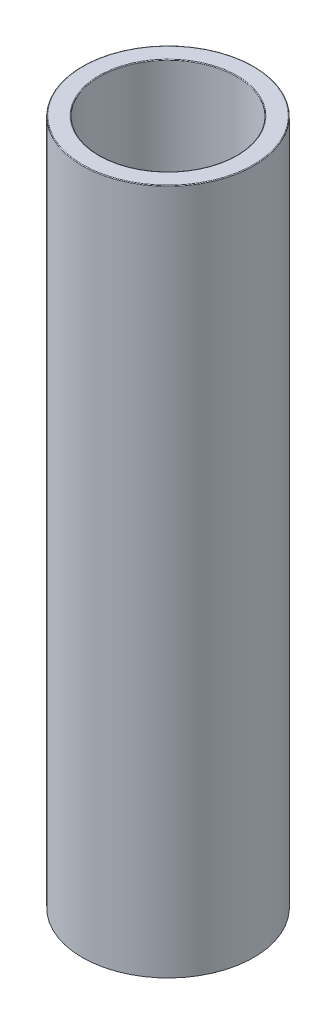
ISO-10303-21;
HEADER;
FILE_DESCRIPTION(('STEP AP214'),'2;1');
FILE_NAME('part.step','',(''),(''),'','','');
FILE_SCHEMA(('AUTOMOTIVE_DESIGN { 1 0 10303 214 1 1 1 1 }'));
ENDSEC;
DATA;
#1=APPLICATION_CONTEXT('core data for automotive mechanical design processes');
#2=APPLICATION_PROTOCOL_DEFINITION('international standard','automotive_design',2000,#1);
#3=PRODUCT_CONTEXT('',#1,'mechanical');
#4=PRODUCT('Part','Part','',(#3));
#5=PRODUCT_RELATED_PRODUCT_CATEGORY('part','',(#4));
#6=PRODUCT_DEFINITION_FORMATION('','',#4);
#7=PRODUCT_DEFINITION_CONTEXT('part definition',#1,'design');
#8=PRODUCT_DEFINITION('design','',#6,#7);
#9=PRODUCT_DEFINITION_SHAPE('','',#8);
#10=(LENGTH_UNIT() NAMED_UNIT(*) SI_UNIT(.MILLI.,.METRE.));
#11=(NAMED_UNIT(*) PLANE_ANGLE_UNIT() SI_UNIT($,.RADIAN.));
#12=(NAMED_UNIT(*) SI_UNIT($,.STERADIAN.) SOLID_ANGLE_UNIT());
#13=UNCERTAINTY_MEASURE_WITH_UNIT(LENGTH_MEASURE(1.E-05),#10,'distance_accuracy_value','');
#14=(GEOMETRIC_REPRESENTATION_CONTEXT(3) GLOBAL_UNCERTAINTY_ASSIGNED_CONTEXT((#13)) GLOBAL_UNIT_ASSIGNED_CONTEXT((#10,
#11,#12)) REPRESENTATION_CONTEXT('',''));
#15=CARTESIAN_POINT('',(0.,0.,0.));
#16=DIRECTION('',(0.,0.,1.));
#17=DIRECTION('',(1.,0.,0.));
#18=AXIS2_PLACEMENT_3D('',#15,#16,#17);
#19=CARTESIAN_POINT('',(0.,10.,0.));
#20=DIRECTION('',(0.,1.,0.));
#21=DIRECTION('',(0.,0.,1.));
#22=AXIS2_PLACEMENT_3D('',#19,#20,#21);
#23=PLANE('',#22);
#24=CARTESIAN_POINT('',(0.,10.,0.));
#25=DIRECTION('',(0.,1.,0.));
#26=DIRECTION('',(0.,0.,1.));
#27=AXIS2_PLACEMENT_3D('',#24,#25,#26);
#28=CIRCLE('',#27,1.24);
#29=CARTESIAN_POINT('',(0.,10.,1.24));
#30=VERTEX_POINT('',#29);
#31=EDGE_CURVE('E61',#30,#30,#28,.T.);
#32=ORIENTED_EDGE('',*,*,#31,.T.);
#33=EDGE_LOOP('',(#32));
#34=FACE_BOUND('',#33,.T.);
#35=CARTESIAN_POINT('',(0.,10.,0.));
#36=DIRECTION('',(0.,1.,0.));
#37=DIRECTION('',(0.,0.,1.));
#38=AXIS2_PLACEMENT_3D('',#35,#36,#37);
#39=CIRCLE('',#38,1.01);
#40=CARTESIAN_POINT('',(0.,10.,1.01));
#41=VERTEX_POINT('',#40);
#42=EDGE_CURVE('E65',#41,#41,#39,.F.);
#43=ORIENTED_EDGE('',*,*,#42,.T.);
#44=EDGE_LOOP('',(#43));
#45=FACE_BOUND('',#44,.T.);
#46=ADVANCED_FACE('F37',(#34,#45),#23,.T.);
#47=CARTESIAN_POINT('',(0.,0.,0.));
#48=DIRECTION('',(0.,1.,0.));
#49=DIRECTION('',(0.,0.,1.));
#50=AXIS2_PLACEMENT_3D('',#47,#48,#49);
#51=PLANE('',#50);
#52=CARTESIAN_POINT('',(0.,0.,0.));
#53=DIRECTION('',(0.,1.,0.));
#54=DIRECTION('',(0.,0.,1.));
#55=AXIS2_PLACEMENT_3D('',#52,#53,#54);
#56=CIRCLE('',#55,1.01);
#57=CARTESIAN_POINT('',(0.,0.,1.01));
#58=VERTEX_POINT('',#57);
#59=EDGE_CURVE('E50',#58,#58,#56,.T.);
#60=ORIENTED_EDGE('',*,*,#59,.T.);
#61=EDGE_LOOP('',(#60));
#62=FACE_BOUND('',#61,.T.);
#63=CARTESIAN_POINT('',(0.,0.,0.));
#64=DIRECTION('',(0.,1.,0.));
#65=DIRECTION('',(0.,0.,1.));
#66=AXIS2_PLACEMENT_3D('',#63,#64,#65);
#67=CIRCLE('',#66,1.25);
#68=CARTESIAN_POINT('',(0.,0.,1.25));
#69=VERTEX_POINT('',#68);
#70=EDGE_CURVE('E69',#69,#69,#67,.T.);
#71=ORIENTED_EDGE('',*,*,#70,.F.);
#72=EDGE_LOOP('',(#71));
#73=FACE_BOUND('',#72,.T.);
#74=ADVANCED_FACE('F76',(#62,#73),#51,.F.);
#75=CARTESIAN_POINT('',(0.,10.,0.));
#76=DIRECTION('',(0.,-1.,0.));
#77=DIRECTION('',(0.,0.,-1.));
#78=AXIS2_PLACEMENT_3D('',#75,#76,#77);
#79=CYLINDRICAL_SURFACE('',#78,1.25);
#80=CARTESIAN_POINT('',(0.,9.99,0.));
#81=DIRECTION('',(0.,1.,0.));
#82=DIRECTION('',(0.,0.,1.));
#83=AXIS2_PLACEMENT_3D('',#80,#81,#82);
#84=CIRCLE('',#83,1.25);
#85=CARTESIAN_POINT('',(0.,9.99,1.25));
#86=VERTEX_POINT('',#85);
#87=EDGE_CURVE('E55',#86,#86,#84,.F.);
#88=ORIENTED_EDGE('',*,*,#87,.T.);
#89=EDGE_LOOP('',(#88));
#90=FACE_BOUND('',#89,.T.);
#91=ORIENTED_EDGE('',*,*,#70,.T.);
#92=EDGE_LOOP('',(#91));
#93=FACE_BOUND('',#92,.T.);
#94=ADVANCED_FACE('F74',(#90,#93),#79,.T.);
#95=CARTESIAN_POINT('',(0.,10.,0.));
#96=DIRECTION('',(0.,-1.,0.));
#97=DIRECTION('',(0.,0.,-1.));
#98=AXIS2_PLACEMENT_3D('',#95,#96,#97);
#99=CYLINDRICAL_SURFACE('',#98,1.);
#100=CARTESIAN_POINT('',(0.,0.00999999999999959,0.));
#101=DIRECTION('',(0.,1.,0.));
#102=DIRECTION('',(0.,0.,1.));
#103=AXIS2_PLACEMENT_3D('',#100,#101,#102);
#104=CIRCLE('',#103,1.);
#105=CARTESIAN_POINT('',(0.,0.00999999999999959,1.));
#106=VERTEX_POINT('',#105);
#107=EDGE_CURVE('E10',#106,#106,#104,.F.);
#108=ORIENTED_EDGE('',*,*,#107,.T.);
#109=EDGE_LOOP('',(#108));
#110=FACE_BOUND('',#109,.T.);
#111=CARTESIAN_POINT('',(0.,9.99,0.));
#112=DIRECTION('',(0.,1.,0.));
#113=DIRECTION('',(0.,0.,1.));
#114=AXIS2_PLACEMENT_3D('',#111,#112,#113);
#115=CIRCLE('',#114,1.);
#116=CARTESIAN_POINT('',(0.,9.99,1.));
#117=VERTEX_POINT('',#116);
#118=EDGE_CURVE('E45',#117,#117,#115,.T.);
#119=ORIENTED_EDGE('',*,*,#118,.T.);
#120=EDGE_LOOP('',(#119));
#121=FACE_BOUND('',#120,.T.);
#122=ADVANCED_FACE('F84',(#110,#121),#99,.F.);
#123=CARTESIAN_POINT('',(0.,9.99,0.));
#124=DIRECTION('',(0.,1.,0.));
#125=DIRECTION('',(0.,0.,1.));
#126=AXIS2_PLACEMENT_3D('',#123,#124,#125);
#127=TOROIDAL_SURFACE('',#126,1.24,0.01);
#128=ORIENTED_EDGE('',*,*,#87,.F.);
#129=EDGE_LOOP('',(#128));
#130=FACE_BOUND('',#129,.T.);
#131=ORIENTED_EDGE('',*,*,#31,.F.);
#132=EDGE_LOOP('',(#131));
#133=FACE_BOUND('',#132,.T.);
#134=ADVANCED_FACE('F91',(#130,#133),#127,.T.);
#135=CARTESIAN_POINT('',(0.,0.00999999999999959,0.));
#136=DIRECTION('',(0.,1.,0.));
#137=DIRECTION('',(0.,0.,1.));
#138=AXIS2_PLACEMENT_3D('',#135,#136,#137);
#139=TOROIDAL_SURFACE('',#138,1.01,0.01);
#140=ORIENTED_EDGE('',*,*,#107,.F.);
#141=EDGE_LOOP('',(#140));
#142=FACE_BOUND('',#141,.T.);
#143=ORIENTED_EDGE('',*,*,#59,.F.);
#144=EDGE_LOOP('',(#143));
#145=FACE_BOUND('',#144,.T.);
#146=ADVANCED_FACE('F93',(#142,#145),#139,.T.);
#147=CARTESIAN_POINT('',(0.,9.99,0.));
#148=DIRECTION('',(0.,1.,0.));
#149=DIRECTION('',(0.,0.,1.));
#150=AXIS2_PLACEMENT_3D('',#147,#148,#149);
#151=TOROIDAL_SURFACE('',#150,1.01,0.01);
#152=ORIENTED_EDGE('',*,*,#42,.F.);
#153=EDGE_LOOP('',(#152));
#154=FACE_BOUND('',#153,.T.);
#155=ORIENTED_EDGE('',*,*,#118,.F.);
#156=EDGE_LOOP('',(#155));
#157=FACE_BOUND('',#156,.T.);
#158=ADVANCED_FACE('F39',(#154,#157),#151,.T.);
#159=CLOSED_SHELL('',(#46,#74,#94,#122,#134,#146,#158));
#160=MANIFOLD_SOLID_BREP('B2',#159);
#161=ADVANCED_BREP_SHAPE_REPRESENTATION('',(#18,#160),#14);
#162=SHAPE_DEFINITION_REPRESENTATION(#9,#161);
ENDSEC;
END-ISO-10303-21;
